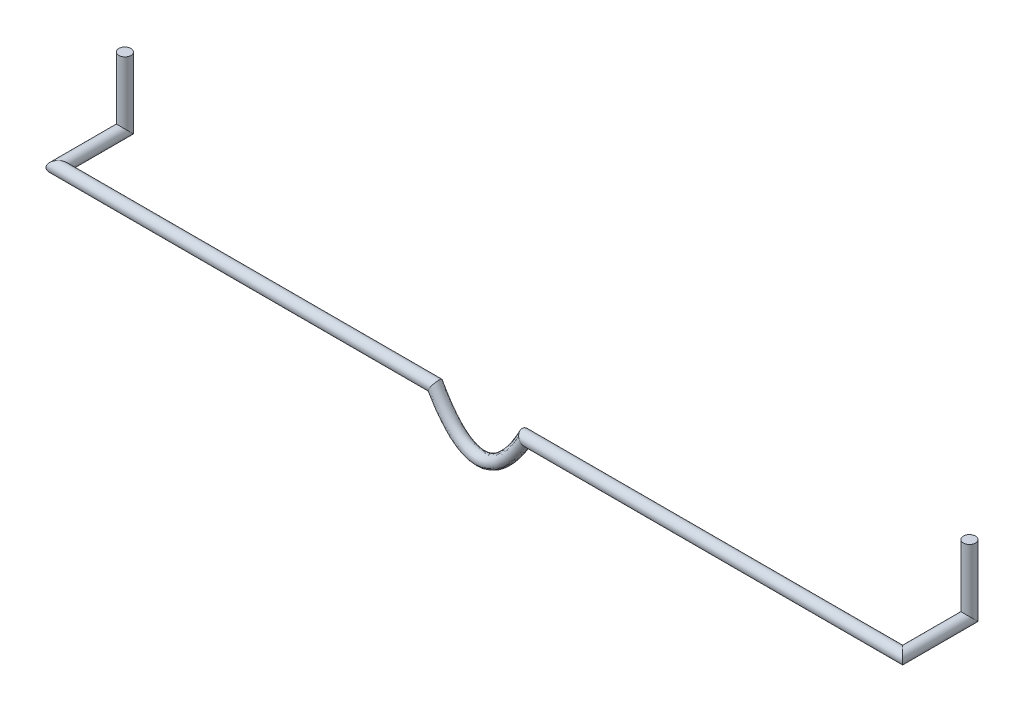
ISO-10303-21;
HEADER;
FILE_DESCRIPTION(('STEP AP214'),'2;1');
FILE_NAME('part.step','',(''),(''),'','','');
FILE_SCHEMA(('AUTOMOTIVE_DESIGN { 1 0 10303 214 1 1 1 1 }'));
ENDSEC;
DATA;
#1=APPLICATION_CONTEXT('core data for automotive mechanical design processes');
#2=APPLICATION_PROTOCOL_DEFINITION('international standard','automotive_design',2000,#1);
#3=PRODUCT_CONTEXT('',#1,'mechanical');
#4=PRODUCT('Part','Part','',(#3));
#5=PRODUCT_RELATED_PRODUCT_CATEGORY('part','',(#4));
#6=PRODUCT_DEFINITION_FORMATION('','',#4);
#7=PRODUCT_DEFINITION_CONTEXT('part definition',#1,'design');
#8=PRODUCT_DEFINITION('design','',#6,#7);
#9=PRODUCT_DEFINITION_SHAPE('','',#8);
#10=(LENGTH_UNIT() NAMED_UNIT(*) SI_UNIT(.MILLI.,.METRE.));
#11=(NAMED_UNIT(*) PLANE_ANGLE_UNIT() SI_UNIT($,.RADIAN.));
#12=(NAMED_UNIT(*) SI_UNIT($,.STERADIAN.) SOLID_ANGLE_UNIT());
#13=UNCERTAINTY_MEASURE_WITH_UNIT(LENGTH_MEASURE(1.E-05),#10,'distance_accuracy_value','');
#14=(GEOMETRIC_REPRESENTATION_CONTEXT(3) GLOBAL_UNCERTAINTY_ASSIGNED_CONTEXT((#13)) GLOBAL_UNIT_ASSIGNED_CONTEXT((#10,
#11,#12)) REPRESENTATION_CONTEXT('',''));
#15=CARTESIAN_POINT('',(0.,0.,0.));
#16=DIRECTION('',(0.,0.,1.));
#17=DIRECTION('',(1.,0.,0.));
#18=AXIS2_PLACEMENT_3D('',#15,#16,#17);
#19=CARTESIAN_POINT('',(450.088,0.,0.));
#20=DIRECTION('',(0.,-1.,0.));
#21=DIRECTION('',(0.,0.,1.));
#22=AXIS2_PLACEMENT_3D('',#19,#20,#21);
#23=PLANE('',#22);
#24=CARTESIAN_POINT('',(450.088,0.,0.));
#25=DIRECTION('',(0.,-1.,0.));
#26=DIRECTION('',(0.,0.,1.));
#27=AXIS2_PLACEMENT_3D('',#24,#25,#26);
#28=CIRCLE('',#27,3.2385);
#29=CARTESIAN_POINT('',(450.088,0.,3.23850000000001));
#30=VERTEX_POINT('',#29);
#31=EDGE_CURVE('E35',#30,#30,#28,.T.);
#32=ORIENTED_EDGE('',*,*,#31,.F.);
#33=EDGE_LOOP('',(#32));
#34=FACE_BOUND('',#33,.T.);
#35=ADVANCED_FACE('F32',(#34),#23,.F.);
#36=CARTESIAN_POINT('',(0.,0.,0.));
#37=DIRECTION('',(0.,1.,0.));
#38=DIRECTION('',(0.,0.,1.));
#39=AXIS2_PLACEMENT_3D('',#36,#37,#38);
#40=PLANE('',#39);
#41=CARTESIAN_POINT('',(0.,0.,0.));
#42=DIRECTION('',(0.,1.,0.));
#43=DIRECTION('',(0.,0.,1.));
#44=AXIS2_PLACEMENT_3D('',#41,#42,#43);
#45=CIRCLE('',#44,3.2385);
#46=CARTESIAN_POINT('',(0.,0.,3.2385));
#47=VERTEX_POINT('',#46);
#48=EDGE_CURVE('E40',#47,#47,#45,.T.);
#49=ORIENTED_EDGE('',*,*,#48,.T.);
#50=EDGE_LOOP('',(#49));
#51=FACE_BOUND('',#50,.T.);
#52=ADVANCED_FACE('F116',(#51),#40,.T.);
#53=CARTESIAN_POINT('',(450.088,-39.22235,0.));
#54=DIRECTION('',(0.,1.,0.));
#55=DIRECTION('',(0.,0.,1.));
#56=AXIS2_PLACEMENT_3D('',#53,#54,#55);
#57=CYLINDRICAL_SURFACE('',#56,3.2385);
#58=CARTESIAN_POINT('',(450.088,-35.56,0.));
#59=DIRECTION('',(0.,0.707106781186548,-0.707106781186548));
#60=DIRECTION('',(0.,-0.707106781186548,-0.707106781186548));
#61=AXIS2_PLACEMENT_3D('',#58,#59,#60);
#62=ELLIPSE('',#61,4.57993062174527,3.2385);
#63=CARTESIAN_POINT('',(450.088,-38.7985,-3.23849999999999));
#64=VERTEX_POINT('',#63);
#65=EDGE_CURVE('E50',#64,#64,#62,.T.);
#66=ORIENTED_EDGE('',*,*,#65,.T.);
#67=EDGE_LOOP('',(#66));
#68=FACE_BOUND('',#67,.T.);
#69=ORIENTED_EDGE('',*,*,#31,.T.);
#70=EDGE_LOOP('',(#69));
#71=FACE_BOUND('',#70,.T.);
#72=ADVANCED_FACE('F118',(#68,#71),#57,.T.);
#73=CARTESIAN_POINT('',(450.088,-35.56,42.7847));
#74=DIRECTION('',(0.,0.,-1.));
#75=DIRECTION('',(-1.,0.,0.));
#76=AXIS2_PLACEMENT_3D('',#73,#74,#75);
#77=CYLINDRICAL_SURFACE('',#76,3.2385);
#78=CARTESIAN_POINT('',(450.088,-35.56,35.56));
#79=DIRECTION('',(0.707106781186547,0.,-0.707106781186547));
#80=DIRECTION('',(0.707106781186548,0.,0.707106781186548));
#81=AXIS2_PLACEMENT_3D('',#78,#79,#80);
#82=ELLIPSE('',#81,4.57993062174527,3.2385);
#83=CARTESIAN_POINT('',(453.3265,-35.56,38.7985));
#84=VERTEX_POINT('',#83);
#85=EDGE_CURVE('E153',#84,#84,#82,.T.);
#86=ORIENTED_EDGE('',*,*,#85,.T.);
#87=EDGE_LOOP('',(#86));
#88=FACE_BOUND('',#87,.T.);
#89=ORIENTED_EDGE('',*,*,#65,.F.);
#90=EDGE_LOOP('',(#89));
#91=FACE_BOUND('',#90,.T.);
#92=ADVANCED_FACE('F123',(#88,#91),#77,.T.);
#93=CARTESIAN_POINT('',(246.983876614171,-35.56,35.56));
#94=DIRECTION('',(1.,0.,0.));
#95=DIRECTION('',(0.,0.,-1.));
#96=AXIS2_PLACEMENT_3D('',#93,#94,#95);
#97=CYLINDRICAL_SURFACE('',#96,3.2385);
#98=CARTESIAN_POINT('',(249.174,-35.56,32.3215));
#99=CARTESIAN_POINT('',(249.176054793598,-35.5635021418316,32.3214999911794));
#100=CARTESIAN_POINT('',(249.178109613021,-35.5670044358151,32.3215056723221));
#101=CARTESIAN_POINT('',(249.31962978746,-35.8082229789254,32.3222888655226));
#102=CARTESIAN_POINT('',(249.459171307487,-36.0465667066486,32.3492749519573));
#103=CARTESIAN_POINT('',(249.733063155369,-36.5153550059829,32.4562661362609));
#104=CARTESIAN_POINT('',(249.867394275573,-36.745770051262,32.5364507091079));
#105=CARTESIAN_POINT('',(250.051458674251,-37.062094172102,32.6889601098426));
#106=CARTESIAN_POINT('',(250.105961927077,-37.1558432220241,32.739949436725));
#107=CARTESIAN_POINT('',(250.212298864574,-37.3388955405039,32.8516993349338));
#108=CARTESIAN_POINT('',(250.26413412718,-37.4282014358144,32.9124540409636));
#109=CARTESIAN_POINT('',(250.364532369726,-37.6013057183687,33.043508505734));
#110=CARTESIAN_POINT('',(250.41309893771,-37.6851101420003,33.1137975342756));
#111=CARTESIAN_POINT('',(250.506400007599,-37.8462182403497,33.263659802093));
#112=CARTESIAN_POINT('',(250.551137133552,-37.9235263658494,33.343226594211));
#113=CARTESIAN_POINT('',(250.631264902887,-38.0620780622159,33.5015438396844));
#114=CARTESIAN_POINT('',(250.667138378603,-38.1241459938176,33.5793292484672));
#115=CARTESIAN_POINT('',(250.734940888716,-38.2415154656424,33.7413859687224));
#116=CARTESIAN_POINT('',(250.766872421391,-38.2968212912571,33.8256531167323));
#117=CARTESIAN_POINT('',(250.826339694067,-38.399863572172,34.0000920438554));
#118=CARTESIAN_POINT('',(250.853878090205,-38.4476046011114,34.0902602082827));
#119=CARTESIAN_POINT('',(250.904137990515,-38.534766900497,34.2758099851822));
#120=CARTESIAN_POINT('',(250.926860407769,-38.5741897480189,34.3711906050799));
#121=CARTESIAN_POINT('',(250.964084600143,-38.6387905317279,34.5516844329536));
#122=CARTESIAN_POINT('',(250.979307208205,-38.6652164525512,34.6362046764752));
#123=CARTESIAN_POINT('',(251.005768714893,-38.7111607831039,34.8077067560079));
#124=CARTESIAN_POINT('',(251.017008205992,-38.7306802201442,34.8946882238416));
#125=CARTESIAN_POINT('',(251.035334362611,-38.7625104831836,35.0703359053587));
#126=CARTESIAN_POINT('',(251.042423587242,-38.7748257513669,35.1590010459667));
#127=CARTESIAN_POINT('',(251.052351554454,-38.7920731911271,35.3372818502735));
#128=CARTESIAN_POINT('',(251.055190581678,-38.7970058571303,35.4268974499136));
#129=CARTESIAN_POINT('',(251.056504555311,-38.7992887822404,35.5970797538976));
#130=CARTESIAN_POINT('',(251.055396094353,-38.7973628537835,35.6776346544125));
#131=CARTESIAN_POINT('',(251.049733649073,-38.7875251927279,35.8382839570606));
#132=CARTESIAN_POINT('',(251.045178512241,-38.7796114579083,35.9183781961278));
#133=CARTESIAN_POINT('',(251.032679418428,-38.7578992041375,36.0774562103693));
#134=CARTESIAN_POINT('',(251.02473725948,-38.7441038075257,36.1564405517963));
#135=CARTESIAN_POINT('',(251.005563831395,-38.7108057651239,36.3127998698258));
#136=CARTESIAN_POINT('',(250.994331322601,-38.6913009682912,36.3901742280702));
#137=CARTESIAN_POINT('',(250.956148056588,-38.6250119383955,36.6174750903641));
#138=CARTESIAN_POINT('',(250.924565700201,-38.5701994573701,36.7643864016023));
#139=CARTESIAN_POINT('',(250.850313232663,-38.4414174128314,37.0464089617557));
#140=CARTESIAN_POINT('',(250.807640232638,-38.3674428580258,37.1815171239342));
#141=CARTESIAN_POINT('',(250.709292943241,-38.1970951613416,37.4468518578101));
#142=CARTESIAN_POINT('',(250.652902068504,-38.0994898768808,37.576020468911));
#143=CARTESIAN_POINT('',(250.531068487855,-37.8888267813352,37.8161010103745));
#144=CARTESIAN_POINT('',(250.465623557042,-37.7757651721674,37.9270084386038));
#145=CARTESIAN_POINT('',(250.319064117692,-37.5228575544848,38.1418301080608));
#146=CARTESIAN_POINT('',(250.237012035037,-37.3814267434941,38.2432368684673));
#147=CARTESIAN_POINT('',(250.066079253296,-37.0871997343628,38.4209700035123));
#148=CARTESIAN_POINT('',(249.977189305048,-36.9343881513634,38.4972616434982));
#149=CARTESIAN_POINT('',(249.773027536255,-36.5839181736976,38.6394876076495));
#150=CARTESIAN_POINT('',(249.656506540645,-36.3842326915118,38.6986511863809));
#151=CARTESIAN_POINT('',(249.420028295055,-35.9797171390477,38.7777721960537));
#152=CARTESIAN_POINT('',(249.300079542122,-35.7748999229585,38.7978192652938));
#153=CARTESIAN_POINT('',(249.178109619621,-35.5670044474191,38.7984943287222));
#154=CARTESIAN_POINT('',(249.176054800142,-35.5635021533456,38.7985000099412));
#155=CARTESIAN_POINT('',(249.174,-35.56,38.7985));
#156=B_SPLINE_CURVE_WITH_KNOTS('',3,(#98,#99,#100,#101,#102,#103,#104,#105,#106,#107,#108,#109,
#110,#111,#112,#113,#114,#115,#116,#117,#118,#119,#120,#121,#122,#123,#124,#125,#126,#127,#128,
#129,#130,#131,#132,#133,#134,#135,#136,#137,#138,#139,#140,#141,#142,#143,#144,#145,#146,#147,
#148,#149,#150,#151,#152,#153,#154,#155),.UNSPECIFIED.,.F.,.F.,(4,2,2,2,2,2,2,2,2,2,2,2,2,2,2,2,
2,2,2,2,2,2,2,2,2,2,2,2,4),(0.,0.0121817468272182,0.838978375580289,1.66857863758955,
2.02766056791721,2.38652762633704,2.74499410560405,3.10321295306018,3.42010056530765,
3.73678630187669,4.05327983516158,4.36971330920602,4.63890659631463,4.9080598251864,
5.17704691526329,5.44601598997284,5.68747959453372,5.92902397613135,6.17044029081306,
6.41194767752567,6.88953845192276,7.36725375336719,7.87948384114254,8.39184002624056,
8.96675729627666,9.5424663788564,10.2549997208453,10.9658983147959,10.9780800616231),.UNSPECIFIED.);
#157=CARTESIAN_POINT('',(249.174,-35.56,38.7985));
#158=VERTEX_POINT('',#157);
#159=CARTESIAN_POINT('',(249.174,-35.56,32.3215));
#160=VERTEX_POINT('',#159);
#161=EDGE_CURVE('E146',#158,#160,#156,.F.);
#162=ORIENTED_EDGE('',*,*,#161,.T.);
#163=CARTESIAN_POINT('',(249.174,-35.56,32.3215));
#164=CARTESIAN_POINT('',(249.171945213293,-35.5564978682451,32.3214999837679));
#165=CARTESIAN_POINT('',(249.169890347293,-35.5529956013949,32.3215056650182));
#166=CARTESIAN_POINT('',(249.028389998365,-35.3118256300815,32.3222891951487));
#167=CARTESIAN_POINT('',(248.888623556809,-35.0736111193781,32.3492974925519));
#168=CARTESIAN_POINT('',(248.613948014755,-34.6054611377014,32.4560166167605));
#169=CARTESIAN_POINT('',(248.479057883621,-34.3755579987345,32.5359138775273));
#170=CARTESIAN_POINT('',(248.237341815006,-33.9635837293388,32.7343466571205));
#171=CARTESIAN_POINT('',(248.129166407045,-33.7792125780881,32.8463531464433));
#172=CARTESIAN_POINT('',(247.976660293052,-33.5192854396645,33.0430217640365));
#173=CARTESIAN_POINT('',(247.927482643797,-33.435468440985,33.1132942335546));
#174=CARTESIAN_POINT('',(247.832915573043,-33.2742909972513,33.2631514878196));
#175=CARTESIAN_POINT('',(247.787524902778,-33.1969284238355,33.3427331818691));
#176=CARTESIAN_POINT('',(247.679976521654,-33.0136260079178,33.5521199929948));
#177=CARTESIAN_POINT('',(247.62051088677,-32.9122744636119,33.687417374918));
#178=CARTESIAN_POINT('',(247.513758859446,-32.730329324062,33.9757546300036));
#179=CARTESIAN_POINT('',(247.466467581209,-32.6497274016066,34.1287873497745));
#180=CARTESIAN_POINT('',(247.406252993354,-32.5470993494495,34.3692009369565));
#181=CARTESIAN_POINT('',(247.387927894092,-32.5158665640456,34.4514259221336));
#182=CARTESIAN_POINT('',(247.355163107504,-32.4600231791349,34.6188330782863));
#183=CARTESIAN_POINT('',(247.340721699881,-32.4354096476039,34.7040139210125));
#184=CARTESIAN_POINT('',(247.315937081256,-32.3931674355364,34.876659381071));
#185=CARTESIAN_POINT('',(247.305593336275,-32.3755378449005,34.9641236992519));
#186=CARTESIAN_POINT('',(247.289160407993,-32.3475300196434,35.1405988731597));
#187=CARTESIAN_POINT('',(247.283070825407,-32.3371511044917,35.2296095829422));
#188=CARTESIAN_POINT('',(247.275612558397,-32.3244394416378,35.3999341296419));
#189=CARTESIAN_POINT('',(247.273852726356,-32.3214400328216,35.4811819532342));
#190=CARTESIAN_POINT('',(247.273924174053,-32.3215618062897,35.6436990936885));
#191=CARTESIAN_POINT('',(247.275756622393,-32.3246849803074,35.7249684089426));
#192=CARTESIAN_POINT('',(247.282990298802,-32.337013857184,35.8868395824483));
#193=CARTESIAN_POINT('',(247.288389435746,-32.3462159959868,35.9674418037926));
#194=CARTESIAN_POINT('',(247.302679066289,-32.3705708443322,36.1274377995936));
#195=CARTESIAN_POINT('',(247.311570868166,-32.3857257836662,36.206831109629));
#196=CARTESIAN_POINT('',(247.34271858585,-32.4388130845184,36.4377615729592));
#197=CARTESIAN_POINT('',(247.369678245275,-32.484762374472,36.5869223101215));
#198=CARTESIAN_POINT('',(247.435168836419,-32.5963827009173,36.8748206768314));
#199=CARTESIAN_POINT('',(247.473701377382,-32.6620564801599,37.0135568534554));
#200=CARTESIAN_POINT('',(247.563493436736,-32.8150955335594,37.2860465434251));
#201=CARTESIAN_POINT('',(247.615382771213,-32.903534248091,37.4189884379396));
#202=CARTESIAN_POINT('',(247.728604618019,-33.0965063589356,37.6680690191151));
#203=CARTESIAN_POINT('',(247.78994247923,-33.2010488717331,37.784198115232));
#204=CARTESIAN_POINT('',(247.938344749701,-33.4539815060241,38.0280714538393));
#205=CARTESIAN_POINT('',(248.027824901542,-33.6064889532536,38.1500963868259));
#206=CARTESIAN_POINT('',(248.21582326388,-33.9269081157611,38.3632150839157));
#207=CARTESIAN_POINT('',(248.314353835345,-34.0948408988023,38.4542657212734));
#208=CARTESIAN_POINT('',(248.517806886678,-34.4416007726793,38.6051581706439));
#209=CARTESIAN_POINT('',(248.622756008262,-34.6204732714373,38.6648584355252));
#210=CARTESIAN_POINT('',(248.83581233235,-34.9836010050364,38.752243950905));
#211=CARTESIAN_POINT('',(248.943912446583,-35.1678441584245,38.7799961120667));
#212=CARTESIAN_POINT('',(249.090814255314,-35.4182201287759,38.796062910066));
#213=CARTESIAN_POINT('',(249.129323321355,-35.4838540865247,38.7982700759019));
#214=CARTESIAN_POINT('',(249.169890267754,-35.5529954658341,38.798494314651));
#215=CARTESIAN_POINT('',(249.171945132542,-35.5564977306174,38.798499995634));
#216=CARTESIAN_POINT('',(249.174,-35.56,38.7985));
#217=B_SPLINE_CURVE_WITH_KNOTS('',3,(#163,#164,#165,#166,#167,#168,#169,#170,#171,#172,#173,
#174,#175,#176,#177,#178,#179,#180,#181,#182,#183,#184,#185,#186,#187,#188,#189,#190,#191,#192,
#193,#194,#195,#196,#197,#198,#199,#200,#201,#202,#203,#204,#205,#206,#207,#208,#209,#210,#211,
#212,#213,#214,#215,#216),.UNSPECIFIED.,.F.,.F.,(4,2,2,2,2,2,2,2,2,2,2,2,2,2,2,2,2,2,2,2,2,2,2,
2,2,2,4),(0.,0.0121817468258203,0.83882012122341,1.66838802991481,2.38794438908327,
2.74721125631778,3.10635918234611,3.64161425634175,4.17665418641377,4.44587587501839,
4.71497811367022,4.98404527321504,5.25308717538099,5.49674950329641,5.74049111000327,
5.98408993932789,6.22778010269881,6.70066440791065,7.17361449961028,7.6752292776498,
8.17712907442298,8.81830460586731,9.46036925228998,10.1053084270353,10.7488943987881,
10.9772045538368,10.9893863006626),.UNSPECIFIED.);
#218=EDGE_CURVE('E141',#158,#160,#217,.F.);
#219=ORIENTED_EDGE('',*,*,#218,.F.);
#220=EDGE_LOOP('',(#162,#219));
#221=FACE_BOUND('',#220,.T.);
#222=ORIENTED_EDGE('',*,*,#85,.F.);
#223=EDGE_LOOP('',(#222));
#224=FACE_BOUND('',#223,.T.);
#225=ADVANCED_FACE('F130',(#221,#224),#97,.T.);
#226=CARTESIAN_POINT('',(202.672638503373,-32.0683365984661,35.56));
#227=CARTESIAN_POINT('',(203.028768157886,-32.705621243379,35.56));
#228=CARTESIAN_POINT('',(203.389862392291,-33.3517930044988,35.56));
#229=CARTESIAN_POINT('',(204.236727859011,-34.8672289202754,35.56));
#230=CARTESIAN_POINT('',(204.717414884227,-35.7000764376528,35.5600000000068));
#231=CARTESIAN_POINT('',(205.69041920407,-37.3324192111855,35.5599999999932));
#232=CARTESIAN_POINT('',(206.17572943045,-38.119378593035,35.56));
#233=CARTESIAN_POINT('',(207.627373700757,-40.3923479111062,35.56));
#234=CARTESIAN_POINT('',(208.589483686795,-41.7904289376061,35.56));
#235=CARTESIAN_POINT('',(211.451225238088,-45.6311873356943,35.56));
#236=CARTESIAN_POINT('',(213.327466144928,-47.7187132096921,35.56));
#237=CARTESIAN_POINT('',(216.949364159858,-50.9593588026057,35.56));
#238=CARTESIAN_POINT('',(218.690477057805,-52.1092057413648,35.56));
#239=CARTESIAN_POINT('',(221.977509913193,-53.5797204411117,35.56));
#240=CARTESIAN_POINT('',(223.51610087558,-53.911499999993,35.56));
#241=CARTESIAN_POINT('',(226.571899124016,-53.9115000000069,35.56));
#242=CARTESIAN_POINT('',(228.110490086803,-53.5797204410834,35.56));
#243=CARTESIAN_POINT('',(231.3975229422,-52.1092057413932,35.56));
#244=CARTESIAN_POINT('',(233.138635840067,-50.9593588026152,35.56));
#245=CARTESIAN_POINT('',(236.760533855147,-47.7187132096828,35.56));
#246=CARTESIAN_POINT('',(238.636774761823,-45.6311873357237,35.56));
#247=CARTESIAN_POINT('',(241.498516313249,-41.7904289375915,35.56));
#248=CARTESIAN_POINT('',(242.460626299243,-40.3923479111063,35.56));
#249=CARTESIAN_POINT('',(243.91227056955,-38.1193785930351,35.56));
#250=CARTESIAN_POINT('',(244.397580795905,-37.3324192111887,35.56));
#251=CARTESIAN_POINT('',(245.370585115798,-35.7000764376497,35.56));
#252=CARTESIAN_POINT('',(245.851272141004,-34.8672289202799,35.56));
#253=CARTESIAN_POINT('',(246.698137607698,-33.3517930044956,35.56));
#254=CARTESIAN_POINT('',(247.059231842077,-32.7056212434168,35.56));
#255=CARTESIAN_POINT('',(247.415361496627,-32.0683365984661,35.56));
#256=CARTESIAN_POINT('',(202.672638503373,-32.0683365984661,29.083));
#257=CARTESIAN_POINT('',(203.028768157886,-32.705621243379,29.083));
#258=CARTESIAN_POINT('',(203.389862392291,-33.3517930044988,29.083));
#259=CARTESIAN_POINT('',(204.236727859011,-34.8672289202754,29.083));
#260=CARTESIAN_POINT('',(204.717414884227,-35.7000764376528,29.0830000000068));
#261=CARTESIAN_POINT('',(205.69041920407,-37.3324192111855,29.0829999999932));
#262=CARTESIAN_POINT('',(206.17572943045,-38.119378593035,29.083));
#263=CARTESIAN_POINT('',(207.627373700757,-40.3923479111062,29.083));
#264=CARTESIAN_POINT('',(208.589483686795,-41.7904289376061,29.083));
#265=CARTESIAN_POINT('',(211.451225238088,-45.6311873356943,29.083));
#266=CARTESIAN_POINT('',(213.327466144928,-47.7187132096921,29.083));
#267=CARTESIAN_POINT('',(216.949364159858,-50.9593588026057,29.083));
#268=CARTESIAN_POINT('',(218.690477057805,-52.1092057413648,29.083));
#269=CARTESIAN_POINT('',(221.977509913193,-53.5797204411117,29.083));
#270=CARTESIAN_POINT('',(223.51610087558,-53.911499999993,29.083));
#271=CARTESIAN_POINT('',(226.571899124016,-53.9115000000069,29.083));
#272=CARTESIAN_POINT('',(228.110490086803,-53.5797204410834,29.083));
#273=CARTESIAN_POINT('',(231.3975229422,-52.1092057413932,29.083));
#274=CARTESIAN_POINT('',(233.138635840067,-50.9593588026152,29.083));
#275=CARTESIAN_POINT('',(236.760533855147,-47.7187132096828,29.083));
#276=CARTESIAN_POINT('',(238.636774761823,-45.6311873357237,29.083));
#277=CARTESIAN_POINT('',(241.498516313249,-41.7904289375915,29.083));
#278=CARTESIAN_POINT('',(242.460626299243,-40.3923479111063,29.083));
#279=CARTESIAN_POINT('',(243.91227056955,-38.1193785930351,29.083));
#280=CARTESIAN_POINT('',(244.397580795905,-37.3324192111887,29.083));
#281=CARTESIAN_POINT('',(245.370585115798,-35.7000764376497,29.083));
#282=CARTESIAN_POINT('',(245.851272141004,-34.8672289202799,29.083));
#283=CARTESIAN_POINT('',(246.698137607698,-33.3517930044956,29.083));
#284=CARTESIAN_POINT('',(247.059231842077,-32.7056212434168,29.083));
#285=CARTESIAN_POINT('',(247.415361496627,-32.0683365984661,29.083));
#286=CARTESIAN_POINT('',(197.01858356957,-35.2279555320619,29.083));
#287=CARTESIAN_POINT('',(197.374713224083,-35.8652401769748,29.083));
#288=CARTESIAN_POINT('',(197.725878298663,-36.49364414748,29.083));
#289=CARTESIAN_POINT('',(198.596688807694,-38.0519286532199,29.083));
#290=CARTESIAN_POINT('',(199.121418449159,-38.9620329373636,29.0830000000068));
#291=CARTESIAN_POINT('',(200.159247462543,-40.7031276637979,29.0829999999932));
#292=CARTESIAN_POINT('',(200.679353902884,-41.5466630736274,29.083));
#293=CARTESIAN_POINT('',(202.243959632575,-43.9965062555686,29.083));
#294=CARTESIAN_POINT('',(203.292682979943,-45.5220710624135,29.083));
#295=CARTESIAN_POINT('',(206.463441428437,-49.7775626642662,29.083));
#296=CARTESIAN_POINT('',(208.608867188424,-52.1879534569914,29.083));
#297=CARTESIAN_POINT('',(213.03030250679,-56.1439745307106,29.083));
#298=CARTESIAN_POINT('',(215.3108562755,-57.6928775919276,29.083));
#299=CARTESIAN_POINT('',(220.067156753502,-59.8206962255957,29.083));
#300=CARTESIAN_POINT('',(222.550232457053,-60.3884999999895,29.083));
#301=CARTESIAN_POINT('',(227.537767542289,-60.3885000000104,29.083));
#302=CARTESIAN_POINT('',(230.020843246491,-59.8206962255721,29.083));
#303=CARTESIAN_POINT('',(234.777143724507,-57.6928775919513,29.083));
#304=CARTESIAN_POINT('',(237.057697493135,-56.1439745307013,29.083));
#305=CARTESIAN_POINT('',(241.479132811651,-52.1879534570008,29.083));
#306=CARTESIAN_POINT('',(243.624558571474,-49.7775626642716,29.083));
#307=CARTESIAN_POINT('',(246.795317020102,-45.5220710624109,29.083));
#308=CARTESIAN_POINT('',(247.844040367477,-43.9965062555557,29.083));
#309=CARTESIAN_POINT('',(249.40864609709,-41.5466630736339,29.083));
#310=CARTESIAN_POINT('',(249.928752537445,-40.7031276638009,29.083));
#311=CARTESIAN_POINT('',(250.966581550852,-38.9620329373607,29.083));
#312=CARTESIAN_POINT('',(251.491311192322,-38.0519286532157,29.083));
#313=CARTESIAN_POINT('',(252.362121701326,-36.493644147483,29.083));
#314=CARTESIAN_POINT('',(252.71328677588,-35.8652401770127,29.083));
#315=CARTESIAN_POINT('',(253.06941643043,-35.2279555320619,29.083));
#316=CARTESIAN_POINT('',(197.01858356957,-35.2279555320619,35.56));
#317=CARTESIAN_POINT('',(197.374713224083,-35.8652401769748,35.56));
#318=CARTESIAN_POINT('',(197.725878298663,-36.49364414748,35.56));
#319=CARTESIAN_POINT('',(198.596688807694,-38.0519286532199,35.56));
#320=CARTESIAN_POINT('',(199.121418449159,-38.9620329373636,35.5600000000068));
#321=CARTESIAN_POINT('',(200.159247462543,-40.7031276637979,35.5599999999932));
#322=CARTESIAN_POINT('',(200.679353902884,-41.5466630736274,35.56));
#323=CARTESIAN_POINT('',(202.243959632575,-43.9965062555686,35.56));
#324=CARTESIAN_POINT('',(203.292682979943,-45.5220710624135,35.56));
#325=CARTESIAN_POINT('',(206.463441428437,-49.7775626642662,35.56));
#326=CARTESIAN_POINT('',(208.608867188424,-52.1879534569914,35.56));
#327=CARTESIAN_POINT('',(213.03030250679,-56.1439745307106,35.56));
#328=CARTESIAN_POINT('',(215.3108562755,-57.6928775919276,35.56));
#329=CARTESIAN_POINT('',(220.067156753502,-59.8206962255957,35.56));
#330=CARTESIAN_POINT('',(222.550232457053,-60.388499999993,35.56));
#331=CARTESIAN_POINT('',(227.537767542289,-60.3885000000069,35.56));
#332=CARTESIAN_POINT('',(230.020843246491,-59.8206962255683,35.56));
#333=CARTESIAN_POINT('',(234.777143724507,-57.6928775919551,35.56));
#334=CARTESIAN_POINT('',(237.057697493135,-56.1439745307013,35.56));
#335=CARTESIAN_POINT('',(241.479132811651,-52.1879534570008,35.56));
#336=CARTESIAN_POINT('',(243.624558571474,-49.7775626642716,35.56));
#337=CARTESIAN_POINT('',(246.795317020102,-45.5220710624109,35.56));
#338=CARTESIAN_POINT('',(247.844040367477,-43.9965062555557,35.56));
#339=CARTESIAN_POINT('',(249.40864609709,-41.5466630736339,35.56));
#340=CARTESIAN_POINT('',(249.928752537445,-40.7031276638009,35.56));
#341=CARTESIAN_POINT('',(250.966581550852,-38.9620329373607,35.56));
#342=CARTESIAN_POINT('',(251.491311192322,-38.0519286532175,35.56));
#343=CARTESIAN_POINT('',(252.362121701326,-36.4936441474818,35.56));
#344=CARTESIAN_POINT('',(252.71328677588,-35.8652401770127,35.56));
#345=CARTESIAN_POINT('',(253.06941643043,-35.2279555320619,35.56));
#346=CARTESIAN_POINT('',(197.01858356957,-35.2279555320619,42.037));
#347=CARTESIAN_POINT('',(197.374713224083,-35.8652401769748,42.037));
#348=CARTESIAN_POINT('',(197.725878298663,-36.49364414748,42.037));
#349=CARTESIAN_POINT('',(198.596688807694,-38.0519286532199,42.037));
#350=CARTESIAN_POINT('',(199.121418449159,-38.9620329373636,42.0370000000068));
#351=CARTESIAN_POINT('',(200.159247462543,-40.7031276637979,42.0369999999932));
#352=CARTESIAN_POINT('',(200.679353902884,-41.5466630736274,42.037));
#353=CARTESIAN_POINT('',(202.243959632575,-43.9965062555686,42.037));
#354=CARTESIAN_POINT('',(203.292682979943,-45.5220710624135,42.037));
#355=CARTESIAN_POINT('',(206.463441428437,-49.7775626642662,42.037));
#356=CARTESIAN_POINT('',(208.608867188424,-52.1879534569914,42.037));
#357=CARTESIAN_POINT('',(213.03030250679,-56.1439745307106,42.037));
#358=CARTESIAN_POINT('',(215.3108562755,-57.6928775919276,42.037));
#359=CARTESIAN_POINT('',(220.067156753502,-59.8206962255957,42.037));
#360=CARTESIAN_POINT('',(222.550232457053,-60.3884999999965,42.037));
#361=CARTESIAN_POINT('',(227.537767542289,-60.3885000000035,42.037));
#362=CARTESIAN_POINT('',(230.020843246491,-59.8206962255645,42.037));
#363=CARTESIAN_POINT('',(234.777143724507,-57.692877591959,42.037));
#364=CARTESIAN_POINT('',(237.057697493135,-56.1439745307013,42.037));
#365=CARTESIAN_POINT('',(241.479132811651,-52.1879534570008,42.037));
#366=CARTESIAN_POINT('',(243.624558571474,-49.7775626642716,42.037));
#367=CARTESIAN_POINT('',(246.795317020102,-45.5220710624109,42.037));
#368=CARTESIAN_POINT('',(247.844040367477,-43.9965062555557,42.037));
#369=CARTESIAN_POINT('',(249.40864609709,-41.5466630736339,42.037));
#370=CARTESIAN_POINT('',(249.928752537445,-40.7031276638009,42.037));
#371=CARTESIAN_POINT('',(250.966581550852,-38.9620329373607,42.037));
#372=CARTESIAN_POINT('',(251.491311192322,-38.0519286532193,42.037));
#373=CARTESIAN_POINT('',(252.362121701326,-36.4936441474805,42.037));
#374=CARTESIAN_POINT('',(252.71328677588,-35.8652401770127,42.037));
#375=CARTESIAN_POINT('',(253.06941643043,-35.2279555320619,42.037));
#376=CARTESIAN_POINT('',(202.672638503373,-32.0683365984661,42.037));
#377=CARTESIAN_POINT('',(203.028768157886,-32.705621243379,42.037));
#378=CARTESIAN_POINT('',(203.389862392291,-33.3517930044988,42.037));
#379=CARTESIAN_POINT('',(204.236727859011,-34.8672289202754,42.037));
#380=CARTESIAN_POINT('',(204.717414884227,-35.7000764376528,42.0370000000068));
#381=CARTESIAN_POINT('',(205.69041920407,-37.3324192111855,42.0369999999932));
#382=CARTESIAN_POINT('',(206.17572943045,-38.119378593035,42.037));
#383=CARTESIAN_POINT('',(207.627373700757,-40.3923479111062,42.037));
#384=CARTESIAN_POINT('',(208.589483686795,-41.7904289376061,42.037));
#385=CARTESIAN_POINT('',(211.451225238088,-45.6311873356943,42.037));
#386=CARTESIAN_POINT('',(213.327466144928,-47.7187132096921,42.037));
#387=CARTESIAN_POINT('',(216.949364159858,-50.9593588026057,42.037));
#388=CARTESIAN_POINT('',(218.690477057805,-52.1092057413648,42.037));
#389=CARTESIAN_POINT('',(221.977509913193,-53.5797204411117,42.037));
#390=CARTESIAN_POINT('',(223.51610087558,-53.911499999993,42.037));
#391=CARTESIAN_POINT('',(226.571899124016,-53.9115000000069,42.037));
#392=CARTESIAN_POINT('',(228.110490086803,-53.5797204410834,42.037));
#393=CARTESIAN_POINT('',(231.3975229422,-52.1092057413932,42.037));
#394=CARTESIAN_POINT('',(233.138635840067,-50.9593588026152,42.037));
#395=CARTESIAN_POINT('',(236.760533855147,-47.7187132096828,42.037));
#396=CARTESIAN_POINT('',(238.636774761823,-45.6311873357237,42.037));
#397=CARTESIAN_POINT('',(241.498516313249,-41.7904289375915,42.037));
#398=CARTESIAN_POINT('',(242.460626299243,-40.3923479111063,42.037));
#399=CARTESIAN_POINT('',(243.91227056955,-38.1193785930351,42.037));
#400=CARTESIAN_POINT('',(244.397580795905,-37.3324192111887,42.037));
#401=CARTESIAN_POINT('',(245.370585115798,-35.7000764376497,42.037));
#402=CARTESIAN_POINT('',(245.851272141004,-34.8672289202799,42.037));
#403=CARTESIAN_POINT('',(246.698137607698,-33.3517930044956,42.037));
#404=CARTESIAN_POINT('',(247.059231842077,-32.7056212434168,42.037));
#405=CARTESIAN_POINT('',(247.415361496627,-32.0683365984661,42.037));
#406=CARTESIAN_POINT('',(202.672638503373,-32.0683365984661,35.56));
#407=CARTESIAN_POINT('',(203.028768157886,-32.705621243379,35.56));
#408=CARTESIAN_POINT('',(203.389862392291,-33.3517930044988,35.56));
#409=CARTESIAN_POINT('',(204.236727859011,-34.8672289202754,35.56));
#410=CARTESIAN_POINT('',(204.717414884227,-35.7000764376528,35.5600000000068));
#411=CARTESIAN_POINT('',(205.69041920407,-37.3324192111855,35.5599999999932));
#412=CARTESIAN_POINT('',(206.17572943045,-38.119378593035,35.56));
#413=CARTESIAN_POINT('',(207.627373700757,-40.3923479111062,35.56));
#414=CARTESIAN_POINT('',(208.589483686795,-41.7904289376061,35.56));
#415=CARTESIAN_POINT('',(211.451225238088,-45.6311873356943,35.56));
#416=CARTESIAN_POINT('',(213.327466144928,-47.7187132096921,35.56));
#417=CARTESIAN_POINT('',(216.949364159858,-50.9593588026057,35.56));
#418=CARTESIAN_POINT('',(218.690477057805,-52.1092057413648,35.56));
#419=CARTESIAN_POINT('',(221.977509913193,-53.5797204411117,35.56));
#420=CARTESIAN_POINT('',(223.51610087558,-53.911499999993,35.56));
#421=CARTESIAN_POINT('',(226.571899124016,-53.9115000000069,35.56));
#422=CARTESIAN_POINT('',(228.110490086803,-53.5797204410834,35.56));
#423=CARTESIAN_POINT('',(231.3975229422,-52.1092057413932,35.56));
#424=CARTESIAN_POINT('',(233.138635840067,-50.9593588026152,35.56));
#425=CARTESIAN_POINT('',(236.760533855147,-47.7187132096828,35.56));
#426=CARTESIAN_POINT('',(238.636774761823,-45.6311873357237,35.56));
#427=CARTESIAN_POINT('',(241.498516313249,-41.7904289375915,35.56));
#428=CARTESIAN_POINT('',(242.460626299243,-40.3923479111063,35.56));
#429=CARTESIAN_POINT('',(243.91227056955,-38.1193785930351,35.56));
#430=CARTESIAN_POINT('',(244.397580795905,-37.3324192111887,35.56));
#431=CARTESIAN_POINT('',(245.370585115798,-35.7000764376497,35.56));
#432=CARTESIAN_POINT('',(245.851272141004,-34.8672289202799,35.56));
#433=CARTESIAN_POINT('',(246.698137607698,-33.3517930044956,35.56));
#434=CARTESIAN_POINT('',(247.059231842077,-32.7056212434168,35.56));
#435=CARTESIAN_POINT('',(247.415361496627,-32.0683365984661,35.56));
#436=(BOUNDED_SURFACE() B_SPLINE_SURFACE(3,3,((#226,#227,#228,#229,#230,#231,#232,#233,#234,
#235,#236,#237,#238,#239,#240,#241,#242,#243,#244,#245,#246,#247,#248,#249,#250,#251,#252,#253,
#254,#255),(#256,#257,#258,#259,#260,#261,#262,#263,#264,#265,#266,#267,#268,#269,#270,#271,
#272,#273,#274,#275,#276,#277,#278,#279,#280,#281,#282,#283,#284,#285),(#286,#287,#288,#289,
#290,#291,#292,#293,#294,#295,#296,#297,#298,#299,#300,#301,#302,#303,#304,#305,#306,#307,#308,
#309,#310,#311,#312,#313,#314,#315),(#316,#317,#318,#319,#320,#321,#322,#323,#324,#325,#326,
#327,#328,#329,#330,#331,#332,#333,#334,#335,#336,#337,#338,#339,#340,#341,#342,#343,#344,#345),
(#346,#347,#348,#349,#350,#351,#352,#353,#354,#355,#356,#357,#358,#359,#360,#361,#362,#363,#364,
#365,#366,#367,#368,#369,#370,#371,#372,#373,#374,#375),(#376,#377,#378,#379,#380,#381,#382,
#383,#384,#385,#386,#387,#388,#389,#390,#391,#392,#393,#394,#395,#396,#397,#398,#399,#400,#401,
#402,#403,#404,#405),(#406,#407,#408,#409,#410,#411,#412,#413,#414,#415,#416,#417,#418,#419,
#420,#421,#422,#423,#424,#425,#426,#427,#428,#429,#430,#431,#432,#433,#434,#435)),.UNSPECIFIED.,
.T.,.F.,.F.) B_SPLINE_SURFACE_WITH_KNOTS((4,3,4),(4,2,2,2,2,2,2,2,2,2,2,2,2,2,4),(0.,0.5,1.),
(-0.0221381882206578,0.,0.03125,0.0625,0.125,0.25,0.375,0.5,0.625,0.75,0.875,0.9375,0.96875,1.,
1.02213818822066),.UNSPECIFIED.) GEOMETRIC_REPRESENTATION_ITEM() RATIONAL_B_SPLINE_SURFACE(((1.,
1.,1.,1.,1.,1.,1.,1.,1.,1.,1.,1.,1.,1.,1.,1.,1.,1.,1.,1.,1.,1.,1.,1.,1.,1.,1.,1.,1.,1.),
(0.333333333333333,0.333333333333333,0.333333333333333,0.333333333333333,0.333333333333333,
0.333333333333333,0.333333333333333,0.333333333333333,0.333333333333333,0.333333333333333,
0.333333333333333,0.333333333333333,0.333333333333333,0.333333333333333,0.333333333333333,
0.333333333333333,0.333333333333333,0.333333333333333,0.333333333333333,0.333333333333333,
0.333333333333333,0.333333333333333,0.333333333333333,0.333333333333333,0.333333333333333,
0.333333333333333,0.333333333333333,0.333333333333333,0.333333333333333,0.333333333333333),
(0.333333333333333,0.333333333333333,0.333333333333333,0.333333333333333,0.333333333333333,
0.333333333333333,0.333333333333333,0.333333333333333,0.333333333333333,0.333333333333333,
0.333333333333333,0.333333333333333,0.333333333333333,0.333333333333333,0.333333333333333,
0.333333333333333,0.333333333333333,0.333333333333333,0.333333333333333,0.333333333333333,
0.333333333333333,0.333333333333333,0.333333333333333,0.333333333333333,0.333333333333333,
0.333333333333333,0.333333333333333,0.333333333333333,0.333333333333333,0.333333333333333),(1.,
1.,1.,1.,1.,1.,1.,1.,1.,1.,1.,1.,1.,1.,1.,1.,1.,1.,1.,1.,1.,1.,1.,1.,1.,1.,1.,1.,1.,1.),
(0.333333333333333,0.333333333333333,0.333333333333333,0.333333333333333,0.333333333333333,
0.333333333333333,0.333333333333333,0.333333333333333,0.333333333333333,0.333333333333333,
0.333333333333333,0.333333333333333,0.333333333333333,0.333333333333333,0.333333333333333,
0.333333333333333,0.333333333333333,0.333333333333333,0.333333333333333,0.333333333333333,
0.333333333333333,0.333333333333333,0.333333333333333,0.333333333333333,0.333333333333333,
0.333333333333333,0.333333333333333,0.333333333333333,0.333333333333333,0.333333333333333),
(0.333333333333333,0.333333333333333,0.333333333333333,0.333333333333333,0.333333333333333,
0.333333333333333,0.333333333333333,0.333333333333333,0.333333333333333,0.333333333333333,
0.333333333333333,0.333333333333333,0.333333333333333,0.333333333333333,0.333333333333333,
0.333333333333333,0.333333333333333,0.333333333333333,0.333333333333333,0.333333333333333,
0.333333333333333,0.333333333333333,0.333333333333333,0.333333333333333,0.333333333333333,
0.333333333333333,0.333333333333333,0.333333333333333,0.333333333333333,0.333333333333333),(1.,
1.,1.,1.,1.,1.,1.,1.,1.,1.,1.,1.,1.,1.,1.,1.,1.,1.,1.,1.,1.,1.,1.,1.,1.,1.,1.,1.,1.,1.))) REPRESENTATION_ITEM('') SURFACE());
#437=CARTESIAN_POINT('',(200.914,-35.56,32.3215));
#438=CARTESIAN_POINT('',(200.911945206401,-35.5635021418313,32.3214999911794));
#439=CARTESIAN_POINT('',(200.909890386978,-35.5670044358145,32.3215056723221));
#440=CARTESIAN_POINT('',(200.768370212497,-35.8082229789003,32.322288865523));
#441=CARTESIAN_POINT('',(200.628828692505,-36.0465667066441,32.3492749519577));
#442=CARTESIAN_POINT('',(200.35493684465,-36.5153550059937,32.4562661362619));
#443=CARTESIAN_POINT('',(200.220605724436,-36.7457700512674,32.5364507091095));
#444=CARTESIAN_POINT('',(200.036541325757,-37.062094172106,32.688960109845));
#445=CARTESIAN_POINT('',(199.982038072932,-37.1558432220285,32.7399494367275));
#446=CARTESIAN_POINT('',(199.875701135435,-37.3388955405084,32.8516993349367));
#447=CARTESIAN_POINT('',(199.82386587283,-37.4282014358187,32.9124540409667));
#448=CARTESIAN_POINT('',(199.723467630284,-37.6013057183728,33.0435085057373));
#449=CARTESIAN_POINT('',(199.6749010623,-37.6851101420042,33.113797534279));
#450=CARTESIAN_POINT('',(199.581599992411,-37.8462182403533,33.2636598020966));
#451=CARTESIAN_POINT('',(199.536862866458,-37.9235263658528,33.3432265942146));
#452=CARTESIAN_POINT('',(199.456735097123,-38.0620780622191,33.5015438396883));
#453=CARTESIAN_POINT('',(199.420861621407,-38.1241459938208,33.5793292484713));
#454=CARTESIAN_POINT('',(199.353059111294,-38.2415154656455,33.741385968727));
#455=CARTESIAN_POINT('',(199.321127578619,-38.2968212912602,33.8256531167371));
#456=CARTESIAN_POINT('',(199.261660305943,-38.3998635721749,34.0000920438606));
#457=CARTESIAN_POINT('',(199.234121909803,-38.4476046011142,34.0902602082882));
#458=CARTESIAN_POINT('',(199.183862009494,-38.5347669004996,34.2758099851881));
#459=CARTESIAN_POINT('',(199.16113959224,-38.5741897480214,34.3711906050861));
#460=CARTESIAN_POINT('',(199.123915399865,-38.63879053173,34.5516844329602));
#461=CARTESIAN_POINT('',(199.108692791803,-38.6652164525532,34.636204676482));
#462=CARTESIAN_POINT('',(199.082231285115,-38.7111607831056,34.8077067560149));
#463=CARTESIAN_POINT('',(199.070991794016,-38.7306802201457,34.8946882238487));
#464=CARTESIAN_POINT('',(199.052665637397,-38.7625104831847,35.070335905366));
#465=CARTESIAN_POINT('',(199.045576412766,-38.7748257513679,35.1590010459741));
#466=CARTESIAN_POINT('',(199.035648445554,-38.7920731911276,35.3372818502812));
#467=CARTESIAN_POINT('',(199.03280941833,-38.7970058571307,35.4268974499214));
#468=CARTESIAN_POINT('',(199.031495444697,-38.7992887822403,35.5970797539053));
#469=CARTESIAN_POINT('',(199.032603905655,-38.7973628537833,35.6776346544202));
#470=CARTESIAN_POINT('',(199.038266350935,-38.7875251927273,35.8382839570681));
#471=CARTESIAN_POINT('',(199.042821487767,-38.7796114579074,35.9183781961352));
#472=CARTESIAN_POINT('',(199.055320581581,-38.7578992041364,36.0774562103764));
#473=CARTESIAN_POINT('',(199.063262740528,-38.7441038075244,36.1564405518034));
#474=CARTESIAN_POINT('',(199.082436168614,-38.7108057651223,36.3127998698326));
#475=CARTESIAN_POINT('',(199.093668677408,-38.6913009682894,36.3901742280768));
#476=CARTESIAN_POINT('',(199.131851943421,-38.6250119383934,36.6174750903704));
#477=CARTESIAN_POINT('',(199.163434299808,-38.5701994573677,36.7643864016082));
#478=CARTESIAN_POINT('',(199.237686767346,-38.4414174128286,37.0464089617611));
#479=CARTESIAN_POINT('',(199.280359767371,-38.3674428580229,37.1815171239393));
#480=CARTESIAN_POINT('',(199.378707056769,-38.1970951613383,37.4468518578147));
#481=CARTESIAN_POINT('',(199.435097931506,-38.0994898768773,37.5760204689154));
#482=CARTESIAN_POINT('',(199.556931512155,-37.8888267813313,37.8161010103785));
#483=CARTESIAN_POINT('',(199.622376442968,-37.7757651721633,37.9270084386077));
#484=CARTESIAN_POINT('',(199.768935882318,-37.5228575544801,38.1418301080644));
#485=CARTESIAN_POINT('',(199.850987964974,-37.3814267434892,38.2432368684708));
#486=CARTESIAN_POINT('',(200.021920746714,-37.0871997343567,38.4209700035155));
#487=CARTESIAN_POINT('',(200.110810694962,-36.9343881513565,38.4972616435013));
#488=CARTESIAN_POINT('',(200.314972463755,-36.5839181736926,38.6394876076513));
#489=CARTESIAN_POINT('',(200.431493459367,-36.3842326915103,38.6986511863818));
#490=CARTESIAN_POINT('',(200.667971704944,-35.9797171390423,38.7777721960541));
#491=CARTESIAN_POINT('',(200.78792045786,-35.7748999229458,38.7978192652946));
#492=CARTESIAN_POINT('',(200.909890380378,-35.5670044474188,38.7984943287222));
#493=CARTESIAN_POINT('',(200.911945199858,-35.5635021533455,38.7985000099413));
#494=CARTESIAN_POINT('',(200.914,-35.56,38.7985));
#495=B_SPLINE_CURVE_WITH_KNOTS('',3,(#437,#438,#439,#440,#441,#442,#443,#444,#445,#446,#447,
#448,#449,#450,#451,#452,#453,#454,#455,#456,#457,#458,#459,#460,#461,#462,#463,#464,#465,#466,
#467,#468,#469,#470,#471,#472,#473,#474,#475,#476,#477,#478,#479,#480,#481,#482,#483,#484,#485,
#486,#487,#488,#489,#490,#491,#492,#493,#494),.UNSPECIFIED.,.F.,.F.,(4,2,2,2,2,2,2,2,2,2,2,2,2,
2,2,2,2,2,2,2,2,2,2,2,2,2,2,2,4),(0.,0.0121817468273695,0.838978375580372,1.66857863758962,
2.02766056791708,2.38652762633675,2.74499410560359,3.10321295305951,3.42010056530754,
3.73678630187716,4.05327983516264,4.36971330920767,4.63890659631655,4.90805982518859,
5.17704691526572,5.44601598997554,5.68747959453617,5.92902397613354,6.17044029081499,
6.41194767752736,6.88953845192396,7.36725375336789,7.8794838411434,8.39184002624155,
8.96675729627836,9.54246637885894,10.2549997208423,10.9658983147871,10.9780800616143),.UNSPECIFIED.);
#496=CARTESIAN_POINT('',(200.914,-35.56,38.7985));
#497=VERTEX_POINT('',#496);
#498=CARTESIAN_POINT('',(200.914,-35.56,32.3215));
#499=VERTEX_POINT('',#498);
#500=EDGE_CURVE('E89',#497,#499,#495,.F.);
#501=CARTESIAN_POINT('',(200.914,-35.56,32.3215));
#502=CARTESIAN_POINT('',(200.916054786708,-35.5564978682454,32.3214999837679));
#503=CARTESIAN_POINT('',(200.918109652709,-35.5529956013956,32.3215056650182));
#504=CARTESIAN_POINT('',(201.059610001676,-35.3118256301056,32.322289195149));
#505=CARTESIAN_POINT('',(201.199376443199,-35.0736111193827,32.3492974925523));
#506=CARTESIAN_POINT('',(201.474051985228,-34.6054611376909,32.4560166167615));
#507=CARTESIAN_POINT('',(201.608942116369,-34.3755579987286,32.5359138775288));
#508=CARTESIAN_POINT('',(201.850658184989,-33.9635837293365,32.7343466571226));
#509=CARTESIAN_POINT('',(201.958833592946,-33.7792125780856,32.8463531464452));
#510=CARTESIAN_POINT('',(202.111339706937,-33.519285439663,33.0430217640376));
#511=CARTESIAN_POINT('',(202.160517356192,-33.4354684409841,33.1132942335554));
#512=CARTESIAN_POINT('',(202.255084426947,-33.2742909972513,33.2631514878197));
#513=CARTESIAN_POINT('',(202.300475097212,-33.1969284238359,33.3427331818687));
#514=CARTESIAN_POINT('',(202.408023478336,-33.0136260079184,33.5521199929942));
#515=CARTESIAN_POINT('',(202.467489113221,-32.9122744636123,33.6874173749174));
#516=CARTESIAN_POINT('',(202.574241140546,-32.7303293240621,33.9757546300034));
#517=CARTESIAN_POINT('',(202.621532418782,-32.6497274016066,34.1287873497746));
#518=CARTESIAN_POINT('',(202.681747006639,-32.5470993494494,34.3692009369569));
#519=CARTESIAN_POINT('',(202.700072105901,-32.5158665640454,34.4514259221342));
#520=CARTESIAN_POINT('',(202.73283689249,-32.4600231791347,34.6188330782871));
#521=CARTESIAN_POINT('',(202.747278300113,-32.4354096476036,34.7040139210136));
#522=CARTESIAN_POINT('',(202.772062918738,-32.3931674355361,34.8766593810724));
#523=CARTESIAN_POINT('',(202.782406663719,-32.3755378449002,34.9641236992535));
#524=CARTESIAN_POINT('',(202.798839592002,-32.3475300196432,35.1405988731617));
#525=CARTESIAN_POINT('',(202.804929174588,-32.3371511044914,35.2296095829445));
#526=CARTESIAN_POINT('',(202.812387441597,-32.3244394416377,35.3999341296442));
#527=CARTESIAN_POINT('',(202.814147273638,-32.3214400328216,35.4811819532364));
#528=CARTESIAN_POINT('',(202.814075825942,-32.3215618062897,35.6436990936904));
#529=CARTESIAN_POINT('',(202.812243377601,-32.3246849803075,35.7249684089443));
#530=CARTESIAN_POINT('',(202.805009701192,-32.3370138571841,35.8868395824496));
#531=CARTESIAN_POINT('',(202.799610564249,-32.3462159959869,35.9674418037937));
#532=CARTESIAN_POINT('',(202.785320933705,-32.3705708443323,36.1274377995944));
#533=CARTESIAN_POINT('',(202.776429131828,-32.3857257836663,36.2068311096296));
#534=CARTESIAN_POINT('',(202.745281414144,-32.4388130845184,36.4377615729591));
#535=CARTESIAN_POINT('',(202.718321754718,-32.4847623744718,36.5869223101208));
#536=CARTESIAN_POINT('',(202.652831163574,-32.5963827009165,36.8748206768295));
#537=CARTESIAN_POINT('',(202.61429862261,-32.6620564801588,37.013556853453));
#538=CARTESIAN_POINT('',(202.524506563256,-32.8150955335576,37.2860465434221));
#539=CARTESIAN_POINT('',(202.472617228778,-32.9035342480889,37.4189884379365));
#540=CARTESIAN_POINT('',(202.359395381973,-33.096506358933,37.6680690191121));
#541=CARTESIAN_POINT('',(202.298057520762,-33.2010488717303,37.7841981152289));
#542=CARTESIAN_POINT('',(202.14965525029,-33.4539815060211,38.0280714538368));
#543=CARTESIAN_POINT('',(202.060175098448,-33.6064889532507,38.1500963868239));
#544=CARTESIAN_POINT('',(201.872176736111,-33.9269081157592,38.3632150839146));
#545=CARTESIAN_POINT('',(201.773646164647,-34.0948408988013,38.4542657212727));
#546=CARTESIAN_POINT('',(201.570193113312,-34.4416007726787,38.605158170644));
#547=CARTESIAN_POINT('',(201.465243991726,-34.620473271436,38.6648584355254));
#548=CARTESIAN_POINT('',(201.252187667646,-34.983601005041,38.7522439509056));
#549=CARTESIAN_POINT('',(201.144087553424,-35.1678441584355,38.7799961120674));
#550=CARTESIAN_POINT('',(200.997185744678,-35.4182201287766,38.796062910066));
#551=CARTESIAN_POINT('',(200.958676678632,-35.4838540865195,38.7982700759017));
#552=CARTESIAN_POINT('',(200.918109732245,-35.5529954658333,38.798494314651));
#553=CARTESIAN_POINT('',(200.916054867457,-35.556497730617,38.798499995634));
#554=CARTESIAN_POINT('',(200.914,-35.56,38.7985));
#555=B_SPLINE_CURVE_WITH_KNOTS('',3,(#501,#502,#503,#504,#505,#506,#507,#508,#509,#510,#511,
#512,#513,#514,#515,#516,#517,#518,#519,#520,#521,#522,#523,#524,#525,#526,#527,#528,#529,#530,
#531,#532,#533,#534,#535,#536,#537,#538,#539,#540,#541,#542,#543,#544,#545,#546,#547,#548,#549,
#550,#551,#552,#553,#554),.UNSPECIFIED.,.F.,.F.,(4,2,2,2,2,2,2,2,2,2,2,2,2,2,2,2,2,2,2,2,2,2,2,
2,2,2,4),(0.,0.0121817468259914,0.838820121223865,1.66838802991547,2.38794438908039,
2.74721125631317,3.10635918233978,3.64161425633653,4.17665418640967,4.44587587501493,
4.71497811366739,4.98404527321283,5.2530871753794,5.49674950329432,5.7404911100007,
5.98408993932483,6.22778010269527,6.70066440790539,7.17361449960332,7.67522927764259,
8.17712907441553,8.81830460586136,9.46036925228558,10.1053084270324,10.7488943987866,
10.9772045538286,10.9893863006544),.UNSPECIFIED.);
#556=EDGE_CURVE('E85',#497,#499,#555,.F.);
#557=ORIENTED_EDGE('',*,*,#218,.T.);
#558=ORIENTED_EDGE('',*,*,#161,.F.);
#559=EDGE_LOOP('',(#557,#558));
#560=FACE_BOUND('',#559,.T.);
#561=ORIENTED_EDGE('',*,*,#500,.T.);
#562=ORIENTED_EDGE('',*,*,#556,.F.);
#563=EDGE_LOOP('',(#561,#562));
#564=FACE_BOUND('',#563,.T.);
#565=ADVANCED_FACE('F107',(#560,#564),#436,.F.);
#566=CARTESIAN_POINT('',(-7.22469999999999,-35.56,35.56));
#567=DIRECTION('',(1.,0.,0.));
#568=DIRECTION('',(0.,0.,-1.));
#569=AXIS2_PLACEMENT_3D('',#566,#567,#568);
#570=CYLINDRICAL_SURFACE('',#569,3.2385);
#571=ORIENTED_EDGE('',*,*,#556,.T.);
#572=ORIENTED_EDGE('',*,*,#500,.F.);
#573=EDGE_LOOP('',(#571,#572));
#574=FACE_BOUND('',#573,.T.);
#575=CARTESIAN_POINT('',(0.,-35.56,35.56));
#576=DIRECTION('',(0.707106781186547,0.,0.707106781186547));
#577=DIRECTION('',(-0.707106781186548,0.,0.707106781186548));
#578=AXIS2_PLACEMENT_3D('',#575,#576,#577);
#579=ELLIPSE('',#578,4.57993062174527,3.2385);
#580=CARTESIAN_POINT('',(-3.2385,-35.56,38.7985));
#581=VERTEX_POINT('',#580);
#582=EDGE_CURVE('E83',#581,#581,#579,.T.);
#583=ORIENTED_EDGE('',*,*,#582,.T.);
#584=EDGE_LOOP('',(#583));
#585=FACE_BOUND('',#584,.T.);
#586=ADVANCED_FACE('F80',(#574,#585),#570,.T.);
#587=CARTESIAN_POINT('',(0.,-35.56,-3.66234999999999));
#588=DIRECTION('',(0.,0.,1.));
#589=DIRECTION('',(1.,0.,0.));
#590=AXIS2_PLACEMENT_3D('',#587,#588,#589);
#591=CYLINDRICAL_SURFACE('',#590,3.2385);
#592=CARTESIAN_POINT('',(0.,-35.56,0.));
#593=DIRECTION('',(0.,-0.707106781186548,0.707106781186548));
#594=DIRECTION('',(0.,-0.707106781186548,-0.707106781186548));
#595=AXIS2_PLACEMENT_3D('',#592,#593,#594);
#596=ELLIPSE('',#595,4.57993062174527,3.2385);
#597=CARTESIAN_POINT('',(0.,-38.7985,-3.2385));
#598=VERTEX_POINT('',#597);
#599=EDGE_CURVE('E11',#598,#598,#596,.T.);
#600=ORIENTED_EDGE('',*,*,#599,.T.);
#601=EDGE_LOOP('',(#600));
#602=FACE_BOUND('',#601,.T.);
#603=ORIENTED_EDGE('',*,*,#582,.F.);
#604=EDGE_LOOP('',(#603));
#605=FACE_BOUND('',#604,.T.);
#606=ADVANCED_FACE('F77',(#602,#605),#591,.T.);
#607=CARTESIAN_POINT('',(0.,0.,0.));
#608=DIRECTION('',(0.,-1.,0.));
#609=DIRECTION('',(0.,0.,-1.));
#610=AXIS2_PLACEMENT_3D('',#607,#608,#609);
#611=CYLINDRICAL_SURFACE('',#610,3.2385);
#612=ORIENTED_EDGE('',*,*,#48,.F.);
#613=EDGE_LOOP('',(#612));
#614=FACE_BOUND('',#613,.T.);
#615=ORIENTED_EDGE('',*,*,#599,.F.);
#616=EDGE_LOOP('',(#615));
#617=FACE_BOUND('',#616,.T.);
#618=ADVANCED_FACE('F75',(#614,#617),#611,.T.);
#619=CLOSED_SHELL('',(#35,#52,#72,#92,#225,#565,#586,#606,#618));
#620=MANIFOLD_SOLID_BREP('B2',#619);
#621=ADVANCED_BREP_SHAPE_REPRESENTATION('',(#18,#620),#14);
#622=SHAPE_DEFINITION_REPRESENTATION(#9,#621);
ENDSEC;
END-ISO-10303-21;
